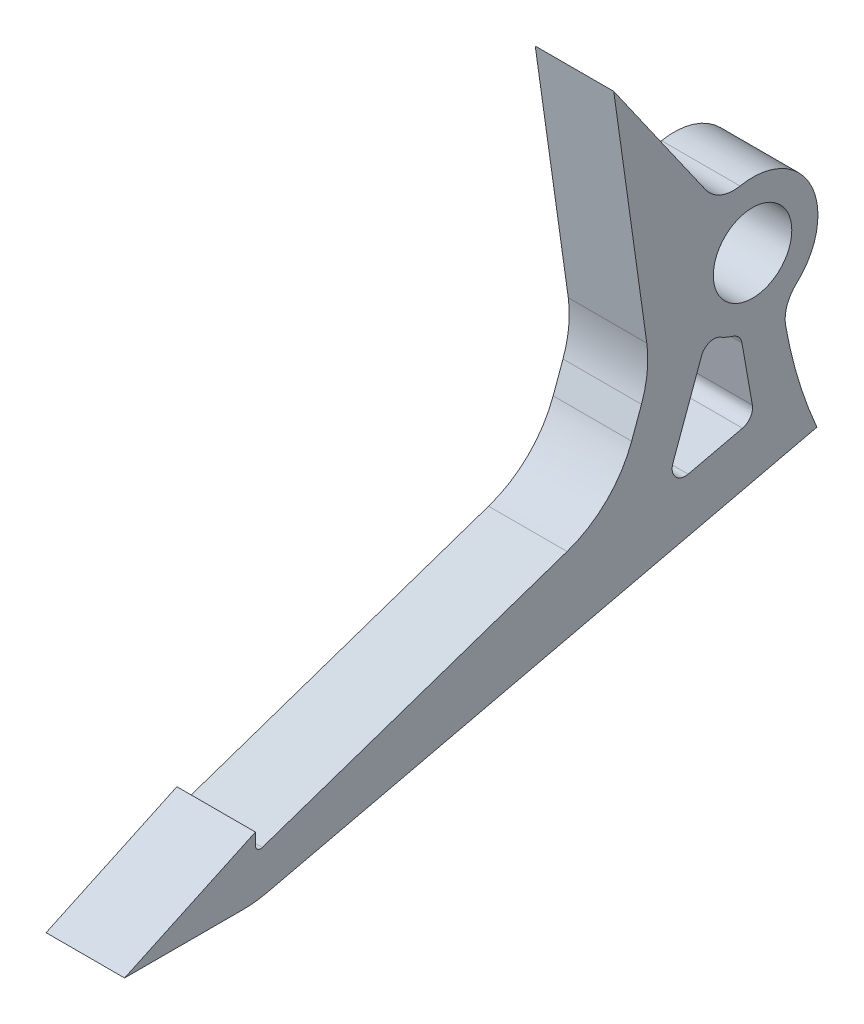
ISO-10303-21;
HEADER;
FILE_DESCRIPTION(('STEP AP214'),'2;1');
FILE_NAME('part.step','',(''),(''),'','','');
FILE_SCHEMA(('AUTOMOTIVE_DESIGN { 1 0 10303 214 1 1 1 1 }'));
ENDSEC;
DATA;
#1=APPLICATION_CONTEXT('core data for automotive mechanical design processes');
#2=APPLICATION_PROTOCOL_DEFINITION('international standard','automotive_design',2000,#1);
#3=PRODUCT_CONTEXT('',#1,'mechanical');
#4=PRODUCT('Part','Part','',(#3));
#5=PRODUCT_RELATED_PRODUCT_CATEGORY('part','',(#4));
#6=PRODUCT_DEFINITION_FORMATION('','',#4);
#7=PRODUCT_DEFINITION_CONTEXT('part definition',#1,'design');
#8=PRODUCT_DEFINITION('design','',#6,#7);
#9=PRODUCT_DEFINITION_SHAPE('','',#8);
#10=(LENGTH_UNIT() NAMED_UNIT(*) SI_UNIT(.MILLI.,.METRE.));
#11=(NAMED_UNIT(*) PLANE_ANGLE_UNIT() SI_UNIT($,.RADIAN.));
#12=(NAMED_UNIT(*) SI_UNIT($,.STERADIAN.) SOLID_ANGLE_UNIT());
#13=UNCERTAINTY_MEASURE_WITH_UNIT(LENGTH_MEASURE(1.E-05),#10,'distance_accuracy_value','');
#14=(GEOMETRIC_REPRESENTATION_CONTEXT(3) GLOBAL_UNCERTAINTY_ASSIGNED_CONTEXT((#13)) GLOBAL_UNIT_ASSIGNED_CONTEXT((#10,
#11,#12)) REPRESENTATION_CONTEXT('',''));
#15=CARTESIAN_POINT('',(0.,0.,0.));
#16=DIRECTION('',(0.,0.,1.));
#17=DIRECTION('',(1.,0.,0.));
#18=AXIS2_PLACEMENT_3D('',#15,#16,#17);
#19=CARTESIAN_POINT('',(-60.325,11.8418556346611,184.872192647918));
#20=DIRECTION('',(1.,0.,0.));
#21=DIRECTION('',(0.,0.,1.));
#22=AXIS2_PLACEMENT_3D('',#19,#20,#21);
#23=PLANE('',#22);
#24=DIRECTION('',(0.,-0.226904101241198,0.973917105733298));
#25=VECTOR('',#24,1.);
#26=CARTESIAN_POINT('',(-60.325,-38.0999999995451,242.8875));
#27=LINE('',#26,#25);
#28=CARTESIAN_POINT('',(-60.325,-22.225,174.748872410197));
#29=VERTEX_POINT('',#28);
#30=CARTESIAN_POINT('',(-60.325,-37.7687472424032,241.465697905031));
#31=VERTEX_POINT('',#30);
#32=EDGE_CURVE('E252',#29,#31,#27,.T.);
#33=ORIENTED_EDGE('',*,*,#32,.F.);
#34=CARTESIAN_POINT('',(-60.325,0.,123.825));
#35=DIRECTION('',(1.,0.,0.));
#36=DIRECTION('',(0.,0.,1.));
#37=AXIS2_PLACEMENT_3D('',#34,#35,#36);
#38=CIRCLE('',#37,55.5625);
#39=CARTESIAN_POINT('',(-60.325,-9.67130748368684,178.539323698699));
#40=VERTEX_POINT('',#39);
#41=EDGE_CURVE('E249',#40,#29,#38,.T.);
#42=ORIENTED_EDGE('',*,*,#41,.F.);
#43=CARTESIAN_POINT('',(-60.325,-8.9528674991844,174.474831081081));
#44=DIRECTION('',(1.,0.,0.));
#45=DIRECTION('',(0.,0.,1.));
#46=AXIS2_PLACEMENT_3D('',#43,#44,#45);
#47=CIRCLE('',#46,4.1275);
#48=CARTESIAN_POINT('',(-60.325,-5.89004440735816,177.241665184922));
#49=VERTEX_POINT('',#48);
#50=EDGE_CURVE('E246',#49,#40,#47,.T.);
#51=ORIENTED_EDGE('',*,*,#50,.F.);
#52=CARTESIAN_POINT('',(-60.325,0.,182.5625));
#53=DIRECTION('',(-1.,0.,0.));
#54=DIRECTION('',(0.,0.,-1.));
#55=AXIS2_PLACEMENT_3D('',#52,#53,#54);
#56=CIRCLE('',#55,7.93749999999999);
#57=CARTESIAN_POINT('',(-60.325,7.79069449648758,184.082034636788));
#58=VERTEX_POINT('',#57);
#59=EDGE_CURVE('E240',#58,#49,#56,.T.);
#60=ORIENTED_EDGE('',*,*,#59,.F.);
#61=CARTESIAN_POINT('',(-60.325,11.8418556346611,184.872192647918));
#62=DIRECTION('',(1.,0.,0.));
#63=DIRECTION('',(0.,0.,1.));
#64=AXIS2_PLACEMENT_3D('',#61,#62,#63);
#65=CIRCLE('',#64,4.1275);
#66=CARTESIAN_POINT('',(-60.325,9.47441889362217,188.25324271072));
#67=VERTEX_POINT('',#66);
#68=EDGE_CURVE('E238',#67,#58,#65,.T.);
#69=ORIENTED_EDGE('',*,*,#68,.F.);
#70=DIRECTION('',(0.,-0.819152044288991,-0.573576436351047));
#71=VECTOR('',#70,1.);
#72=CARTESIAN_POINT('',(-60.325,9.47441889362217,188.25324271072));
#73=LINE('',#72,#71);
#74=CARTESIAN_POINT('',(-60.325,25.4,199.404454651776));
#75=VERTEX_POINT('',#74);
#76=EDGE_CURVE('E216',#75,#67,#73,.T.);
#77=ORIENTED_EDGE('',*,*,#76,.F.);
#78=DIRECTION('',(0.,0.990224211928371,0.139484802436812));
#79=VECTOR('',#78,1.);
#80=CARTESIAN_POINT('',(-60.325,-6.19566556512215,194.953831130232));
#81=LINE('',#80,#79);
#82=CARTESIAN_POINT('',(-60.325,-3.058052243172,195.395801109418));
#83=VERTEX_POINT('',#82);
#84=EDGE_CURVE('E227',#83,#75,#81,.T.);
#85=ORIENTED_EDGE('',*,*,#84,.F.);
#86=CARTESIAN_POINT('',(-60.325,-4.82950923411951,207.971648600909));
#87=DIRECTION('',(-1.,0.,0.));
#88=DIRECTION('',(0.,0.,1.));
#89=AXIS2_PLACEMENT_3D('',#86,#87,#88);
#90=CIRCLE('',#89,12.7);
#91=CARTESIAN_POINT('',(-60.325,-9.17316505460819,196.03755231702));
#92=VERTEX_POINT('',#91);
#93=EDGE_CURVE('E325',#92,#83,#90,.F.);
#94=ORIENTED_EDGE('',*,*,#93,.F.);
#95=DIRECTION('',(0.,0.939692620778666,-0.342020143345566));
#96=VECTOR('',#95,1.);
#97=CARTESIAN_POINT('',(-60.325,-6.19566556512215,194.953831130232));
#98=LINE('',#97,#96);
#99=CARTESIAN_POINT('',(-60.325,-12.4523106077859,197.231063692281));
#100=VERTEX_POINT('',#99);
#101=EDGE_CURVE('E266',#100,#92,#98,.T.);
#102=ORIENTED_EDGE('',*,*,#101,.F.);
#103=CARTESIAN_POINT('',(-60.325,-8.1086547872972,209.16515997617));
#104=DIRECTION('',(-1.,0.,0.));
#105=DIRECTION('',(0.,0.,1.));
#106=AXIS2_PLACEMENT_3D('',#103,#104,#105);
#107=CIRCLE('',#106,12.7);
#108=CARTESIAN_POINT('',(-60.325,-20.1295882858705,205.06794655448));
#109=VERTEX_POINT('',#108);
#110=EDGE_CURVE('E330',#109,#100,#107,.F.);
#111=ORIENTED_EDGE('',*,*,#110,.F.);
#112=DIRECTION('',(0.,0.322615230054343,-0.946530196738056));
#113=VECTOR('',#112,1.);
#114=CARTESIAN_POINT('',(-60.325,-18.1674625629956,199.311208888423));
#115=LINE('',#114,#113);
#116=CARTESIAN_POINT('',(-60.325,-32.7337419968429,242.047639328916));
#117=VERTEX_POINT('',#116);
#118=EDGE_CURVE('E263',#117,#109,#115,.T.);
#119=ORIENTED_EDGE('',*,*,#118,.F.);
#120=CARTESIAN_POINT('',(-60.325,-32.1326953219142,242.2525));
#121=DIRECTION('',(-1.,0.,0.));
#122=DIRECTION('',(0.,0.,1.));
#123=AXIS2_PLACEMENT_3D('',#120,#121,#122);
#124=CIRCLE('',#123,0.635);
#125=CARTESIAN_POINT('',(-60.325,-32.1326953219142,242.8875));
#126=VERTEX_POINT('',#125);
#127=EDGE_CURVE('E380',#126,#117,#124,.F.);
#128=ORIENTED_EDGE('',*,*,#127,.F.);
#129=DIRECTION('',(0.,-1.,0.));
#130=VECTOR('',#129,1.);
#131=CARTESIAN_POINT('',(-60.325,-33.0199999995451,242.8875));
#132=LINE('',#131,#130);
#133=CARTESIAN_POINT('',(-60.325,-30.6973659274248,242.8875));
#134=VERTEX_POINT('',#133);
#135=EDGE_CURVE('E260',#134,#126,#132,.T.);
#136=ORIENTED_EDGE('',*,*,#135,.F.);
#137=DIRECTION('',(0.,0.422618261712625,-0.906307787049741));
#138=VECTOR('',#137,1.);
#139=CARTESIAN_POINT('',(-60.325,-30.6973659274248,242.8875));
#140=LINE('',#139,#138);
#141=CARTESIAN_POINT('',(-60.325,-38.1000000000367,258.7625));
#142=VERTEX_POINT('',#141);
#143=EDGE_CURVE('E257',#142,#134,#140,.T.);
#144=ORIENTED_EDGE('',*,*,#143,.F.);
#145=DIRECTION('',(0.,-3.0969540143215E-11,1.));
#146=VECTOR('',#145,1.);
#147=CARTESIAN_POINT('',(-60.325,-38.1000000000367,258.7625));
#148=LINE('',#147,#146);
#149=CARTESIAN_POINT('',(-60.325,-38.0999999995903,244.347379990401));
#150=VERTEX_POINT('',#149);
#151=EDGE_CURVE('E254',#150,#142,#148,.T.);
#152=ORIENTED_EDGE('',*,*,#151,.F.);
#153=CARTESIAN_POINT('',(-60.325,-25.3999999995903,244.347379990794));
#154=DIRECTION('',(-1.,0.,0.));
#155=DIRECTION('',(0.,0.,1.));
#156=AXIS2_PLACEMENT_3D('',#153,#154,#155);
#157=CIRCLE('',#156,12.7);
#158=EDGE_CURVE('E12',#31,#150,#157,.T.);
#159=ORIENTED_EDGE('',*,*,#158,.F.);
#160=EDGE_LOOP('',(#33,#42,#51,#60,#69,#77,#85,#94,#102,#111,#119,#128,#136,#144,#152,#159));
#161=FACE_BOUND('',#160,.T.);
#162=CARTESIAN_POINT('',(-60.325,0.,182.5625));
#163=DIRECTION('',(-1.,0.,0.));
#164=DIRECTION('',(0.,0.,1.));
#165=AXIS2_PLACEMENT_3D('',#162,#163,#164);
#166=CIRCLE('',#165,4.76250000000001);
#167=CARTESIAN_POINT('',(-60.325,0.,177.8));
#168=VERTEX_POINT('',#167);
#169=EDGE_CURVE('E272',#168,#168,#166,.T.);
#170=ORIENTED_EDGE('',*,*,#169,.T.);
#171=EDGE_LOOP('',(#170));
#172=FACE_BOUND('',#171,.T.);
#173=DIRECTION('',(0.,0.939692620778666,-0.342020143345568));
#174=VECTOR('',#173,1.);
#175=CARTESIAN_POINT('',(-60.325,-5.75019849137348,188.03416551973));
#176=LINE('',#175,#174);
#177=CARTESIAN_POINT('',(-60.325,-17.2552388929691,192.221657770217));
#178=VERTEX_POINT('',#177);
#179=CARTESIAN_POINT('',(-60.325,-7.73946926422555,188.758200868992));
#180=VERTEX_POINT('',#179);
#181=EDGE_CURVE('E806',#178,#180,#176,.T.);
#182=ORIENTED_EDGE('',*,*,#181,.T.);
#183=CARTESIAN_POINT('',(-60.325,-8.28242624178663,187.266438833506));
#184=DIRECTION('',(-1.,0.,0.));
#185=DIRECTION('',(0.,0.,1.));
#186=AXIS2_PLACEMENT_3D('',#183,#184,#185);
#187=CIRCLE('',#186,1.5875);
#188=CARTESIAN_POINT('',(-60.325,-6.90202186815552,186.482449027922));
#189=VERTEX_POINT('',#188);
#190=EDGE_CURVE('E358',#189,#180,#187,.F.);
#191=ORIENTED_EDGE('',*,*,#190,.F.);
#192=CARTESIAN_POINT('',(-60.325,0.,182.5625));
#193=DIRECTION('',(1.,0.,0.));
#194=DIRECTION('',(0.,0.,1.));
#195=AXIS2_PLACEMENT_3D('',#192,#193,#194);
#196=CIRCLE('',#195,7.9375);
#197=CARTESIAN_POINT('',(-60.325,-7.57366766743474,184.938097674955));
#198=VERTEX_POINT('',#197);
#199=EDGE_CURVE('E803',#189,#198,#196,.T.);
#200=ORIENTED_EDGE('',*,*,#199,.T.);
#201=CARTESIAN_POINT('',(-60.325,-9.08840120092169,185.413217209947));
#202=DIRECTION('',(-1.,0.,0.));
#203=DIRECTION('',(0.,0.,1.));
#204=AXIS2_PLACEMENT_3D('',#201,#202,#203);
#205=CIRCLE('',#204,1.5875);
#206=CARTESIAN_POINT('',(-60.325,-8.81207812995921,183.849950818555));
#207=VERTEX_POINT('',#206);
#208=EDGE_CURVE('E364',#207,#198,#205,.F.);
#209=ORIENTED_EDGE('',*,*,#208,.F.);
#210=DIRECTION('',(0.,-0.984734734734735,-0.17406177698424));
#211=VECTOR('',#210,1.);
#212=CARTESIAN_POINT('',(-60.325,-17.4688161294503,182.319785235959));
#213=LINE('',#212,#211);
#214=CARTESIAN_POINT('',(-60.325,-15.9876843333391,182.581590190415));
#215=VERTEX_POINT('',#214);
#216=EDGE_CURVE('E799',#207,#215,#213,.T.);
#217=ORIENTED_EDGE('',*,*,#216,.T.);
#218=CARTESIAN_POINT('',(-60.325,-16.2640074043016,184.144856581806));
#219=DIRECTION('',(-1.,0.,0.));
#220=DIRECTION('',(0.,0.,1.));
#221=AXIS2_PLACEMENT_3D('',#218,#219,#220);
#222=CIRCLE('',#221,1.5875);
#223=CARTESIAN_POINT('',(-60.325,-17.8101008096507,183.784646321075));
#224=VERTEX_POINT('',#223);
#225=EDGE_CURVE('E370',#224,#215,#222,.F.);
#226=ORIENTED_EDGE('',*,*,#225,.F.);
#227=DIRECTION('',(0.,-0.226904101247864,0.973917105731745));
#228=VECTOR('',#227,1.);
#229=CARTESIAN_POINT('',(-60.325,-20.0093029322549,193.224055103846));
#230=LINE('',#229,#228);
#231=CARTESIAN_POINT('',(-60.325,-19.3442892758793,190.369685474));
#232=VERTEX_POINT('',#231);
#233=EDGE_CURVE('E822',#224,#232,#230,.T.);
#234=ORIENTED_EDGE('',*,*,#233,.T.);
#235=CARTESIAN_POINT('',(-60.325,-17.7981958705302,190.729895734731));
#236=DIRECTION('',(-1.,0.,0.));
#237=DIRECTION('',(0.,0.,1.));
#238=AXIS2_PLACEMENT_3D('',#235,#236,#237);
#239=CIRCLE('',#238,1.5875);
#240=EDGE_CURVE('E352',#178,#232,#239,.F.);
#241=ORIENTED_EDGE('',*,*,#240,.F.);
#242=EDGE_LOOP('',(#182,#191,#200,#209,#217,#226,#234,#241));
#243=FACE_BOUND('',#242,.T.);
#244=ADVANCED_FACE('F53',(#161,#172,#243),#23,.T.);
#245=CARTESIAN_POINT('',(-69.85,11.8418556346611,184.872192647918));
#246=DIRECTION('',(1.,0.,0.));
#247=DIRECTION('',(0.,0.,1.));
#248=AXIS2_PLACEMENT_3D('',#245,#246,#247);
#249=PLANE('',#248);
#250=CARTESIAN_POINT('',(-69.85,0.,182.5625));
#251=DIRECTION('',(-1.,0.,0.));
#252=DIRECTION('',(0.,0.,1.));
#253=AXIS2_PLACEMENT_3D('',#250,#251,#252);
#254=CIRCLE('',#253,4.76250000000001);
#255=CARTESIAN_POINT('',(-69.85,0.,177.8));
#256=VERTEX_POINT('',#255);
#257=EDGE_CURVE('E802',#256,#256,#254,.T.);
#258=ORIENTED_EDGE('',*,*,#257,.F.);
#259=EDGE_LOOP('',(#258));
#260=FACE_BOUND('',#259,.T.);
#261=DIRECTION('',(0.,-3.0969540143215E-11,1.));
#262=VECTOR('',#261,1.);
#263=CARTESIAN_POINT('',(-69.85,-38.1000000000367,258.7625));
#264=LINE('',#263,#262);
#265=CARTESIAN_POINT('',(-69.85,-38.0999999995903,244.347379990401));
#266=VERTEX_POINT('',#265);
#267=CARTESIAN_POINT('',(-69.85,-38.1000000000367,258.7625));
#268=VERTEX_POINT('',#267);
#269=EDGE_CURVE('E289',#266,#268,#264,.T.);
#270=ORIENTED_EDGE('',*,*,#269,.T.);
#271=DIRECTION('',(0.,0.422618261712625,-0.906307787049741));
#272=VECTOR('',#271,1.);
#273=CARTESIAN_POINT('',(-69.85,-30.6973659274248,242.8875));
#274=LINE('',#273,#272);
#275=CARTESIAN_POINT('',(-69.85,-30.6973659274248,242.8875));
#276=VERTEX_POINT('',#275);
#277=EDGE_CURVE('E292',#268,#276,#274,.T.);
#278=ORIENTED_EDGE('',*,*,#277,.T.);
#279=DIRECTION('',(0.,-1.,0.));
#280=VECTOR('',#279,1.);
#281=CARTESIAN_POINT('',(-69.85,-33.0199999995451,242.8875));
#282=LINE('',#281,#280);
#283=CARTESIAN_POINT('',(-69.85,-32.1326953219142,242.8875));
#284=VERTEX_POINT('',#283);
#285=EDGE_CURVE('E295',#276,#284,#282,.T.);
#286=ORIENTED_EDGE('',*,*,#285,.T.);
#287=CARTESIAN_POINT('',(-69.85,-32.1326953219142,242.2525));
#288=DIRECTION('',(-1.,0.,0.));
#289=DIRECTION('',(0.,0.,1.));
#290=AXIS2_PLACEMENT_3D('',#287,#288,#289);
#291=CIRCLE('',#290,0.635);
#292=CARTESIAN_POINT('',(-69.85,-32.7337419968429,242.047639328916));
#293=VERTEX_POINT('',#292);
#294=EDGE_CURVE('E377',#293,#284,#291,.T.);
#295=ORIENTED_EDGE('',*,*,#294,.F.);
#296=DIRECTION('',(0.,0.322615230054343,-0.946530196738056));
#297=VECTOR('',#296,1.);
#298=CARTESIAN_POINT('',(-69.85,-18.1674625629956,199.311208888423));
#299=LINE('',#298,#297);
#300=CARTESIAN_POINT('',(-69.85,-20.1295882858705,205.06794655448));
#301=VERTEX_POINT('',#300);
#302=EDGE_CURVE('E298',#293,#301,#299,.T.);
#303=ORIENTED_EDGE('',*,*,#302,.T.);
#304=CARTESIAN_POINT('',(-69.85,-8.1086547872972,209.16515997617));
#305=DIRECTION('',(-1.,0.,0.));
#306=DIRECTION('',(0.,0.,1.));
#307=AXIS2_PLACEMENT_3D('',#304,#305,#306);
#308=CIRCLE('',#307,12.7);
#309=CARTESIAN_POINT('',(-69.85,-12.4523106077859,197.231063692281));
#310=VERTEX_POINT('',#309);
#311=EDGE_CURVE('E327',#310,#301,#308,.T.);
#312=ORIENTED_EDGE('',*,*,#311,.F.);
#313=DIRECTION('',(0.,0.939692620778666,-0.342020143345566));
#314=VECTOR('',#313,1.);
#315=CARTESIAN_POINT('',(-69.85,-6.19566556512215,194.953831130232));
#316=LINE('',#315,#314);
#317=CARTESIAN_POINT('',(-69.85,-9.17316505460819,196.03755231702));
#318=VERTEX_POINT('',#317);
#319=EDGE_CURVE('E232',#310,#318,#316,.T.);
#320=ORIENTED_EDGE('',*,*,#319,.T.);
#321=CARTESIAN_POINT('',(-69.85,-4.82950923411951,207.971648600909));
#322=DIRECTION('',(-1.,0.,0.));
#323=DIRECTION('',(0.,0.,1.));
#324=AXIS2_PLACEMENT_3D('',#321,#322,#323);
#325=CIRCLE('',#324,12.7);
#326=CARTESIAN_POINT('',(-69.85,-3.058052243172,195.395801109418));
#327=VERTEX_POINT('',#326);
#328=EDGE_CURVE('E322',#327,#318,#325,.T.);
#329=ORIENTED_EDGE('',*,*,#328,.F.);
#330=DIRECTION('',(0.,0.990224211928371,0.139484802436812));
#331=VECTOR('',#330,1.);
#332=CARTESIAN_POINT('',(-69.85,-6.19566556512215,194.953831130232));
#333=LINE('',#332,#331);
#334=CARTESIAN_POINT('',(-69.85,25.4,199.404454651776));
#335=VERTEX_POINT('',#334);
#336=EDGE_CURVE('E270',#327,#335,#333,.T.);
#337=ORIENTED_EDGE('',*,*,#336,.T.);
#338=DIRECTION('',(0.,-0.819152044288991,-0.573576436351047));
#339=VECTOR('',#338,1.);
#340=CARTESIAN_POINT('',(-69.85,9.47441889362217,188.25324271072));
#341=LINE('',#340,#339);
#342=CARTESIAN_POINT('',(-69.85,9.47441889362217,188.25324271072));
#343=VERTEX_POINT('',#342);
#344=EDGE_CURVE('E219',#335,#343,#341,.T.);
#345=ORIENTED_EDGE('',*,*,#344,.T.);
#346=CARTESIAN_POINT('',(-69.85,11.8418556346611,184.872192647918));
#347=DIRECTION('',(1.,0.,0.));
#348=DIRECTION('',(0.,0.,1.));
#349=AXIS2_PLACEMENT_3D('',#346,#347,#348);
#350=CIRCLE('',#349,4.1275);
#351=CARTESIAN_POINT('',(-69.85,7.79069449648758,184.082034636788));
#352=VERTEX_POINT('',#351);
#353=EDGE_CURVE('E274',#343,#352,#350,.T.);
#354=ORIENTED_EDGE('',*,*,#353,.T.);
#355=CARTESIAN_POINT('',(-69.85,0.,182.5625));
#356=DIRECTION('',(-1.,0.,0.));
#357=DIRECTION('',(0.,0.,1.));
#358=AXIS2_PLACEMENT_3D('',#355,#356,#357);
#359=CIRCLE('',#358,7.9375);
#360=CARTESIAN_POINT('',(-69.85,-5.89004440735816,177.241665184922));
#361=VERTEX_POINT('',#360);
#362=EDGE_CURVE('E277',#352,#361,#359,.T.);
#363=ORIENTED_EDGE('',*,*,#362,.T.);
#364=CARTESIAN_POINT('',(-69.85,-8.9528674991844,174.474831081081));
#365=DIRECTION('',(1.,0.,0.));
#366=DIRECTION('',(0.,0.,1.));
#367=AXIS2_PLACEMENT_3D('',#364,#365,#366);
#368=CIRCLE('',#367,4.1275);
#369=CARTESIAN_POINT('',(-69.85,-9.67130748368684,178.539323698699));
#370=VERTEX_POINT('',#369);
#371=EDGE_CURVE('E280',#361,#370,#368,.T.);
#372=ORIENTED_EDGE('',*,*,#371,.T.);
#373=CARTESIAN_POINT('',(-69.85,0.,123.825));
#374=DIRECTION('',(1.,0.,0.));
#375=DIRECTION('',(0.,0.,1.));
#376=AXIS2_PLACEMENT_3D('',#373,#374,#375);
#377=CIRCLE('',#376,55.5625);
#378=CARTESIAN_POINT('',(-69.85,-22.225,174.748872410197));
#379=VERTEX_POINT('',#378);
#380=EDGE_CURVE('E283',#370,#379,#377,.T.);
#381=ORIENTED_EDGE('',*,*,#380,.T.);
#382=DIRECTION('',(0.,-0.226904101241198,0.973917105733298));
#383=VECTOR('',#382,1.);
#384=CARTESIAN_POINT('',(-69.85,-38.0999999995451,242.8875));
#385=LINE('',#384,#383);
#386=CARTESIAN_POINT('',(-69.85,-37.7687472424032,241.465697905031));
#387=VERTEX_POINT('',#386);
#388=EDGE_CURVE('E286',#379,#387,#385,.T.);
#389=ORIENTED_EDGE('',*,*,#388,.T.);
#390=CARTESIAN_POINT('',(-69.85,-25.3999999995903,244.347379990794));
#391=DIRECTION('',(-1.,0.,0.));
#392=DIRECTION('',(0.,0.,1.));
#393=AXIS2_PLACEMENT_3D('',#390,#391,#392);
#394=CIRCLE('',#393,12.7);
#395=EDGE_CURVE('E385',#266,#387,#394,.F.);
#396=ORIENTED_EDGE('',*,*,#395,.F.);
#397=EDGE_LOOP('',(#270,#278,#286,#295,#303,#312,#320,#329,#337,#345,#354,#363,#372,#381,#389,#396));
#398=FACE_BOUND('',#397,.T.);
#399=DIRECTION('',(0.,-0.984734734734735,-0.17406177698424));
#400=VECTOR('',#399,1.);
#401=CARTESIAN_POINT('',(-69.85,-17.4688161294503,182.319785235959));
#402=LINE('',#401,#400);
#403=CARTESIAN_POINT('',(-69.85,-8.81207812995921,183.849950818555));
#404=VERTEX_POINT('',#403);
#405=CARTESIAN_POINT('',(-69.85,-15.9876843333391,182.581590190415));
#406=VERTEX_POINT('',#405);
#407=EDGE_CURVE('E819',#404,#406,#402,.T.);
#408=ORIENTED_EDGE('',*,*,#407,.F.);
#409=CARTESIAN_POINT('',(-69.85,-9.08840120092169,185.413217209947));
#410=DIRECTION('',(-1.,0.,0.));
#411=DIRECTION('',(0.,0.,1.));
#412=AXIS2_PLACEMENT_3D('',#409,#410,#411);
#413=CIRCLE('',#412,1.5875);
#414=CARTESIAN_POINT('',(-69.85,-7.57366766743474,184.938097674955));
#415=VERTEX_POINT('',#414);
#416=EDGE_CURVE('E361',#415,#404,#413,.T.);
#417=ORIENTED_EDGE('',*,*,#416,.F.);
#418=CARTESIAN_POINT('',(-69.85,0.,182.5625));
#419=DIRECTION('',(1.,0.,0.));
#420=DIRECTION('',(0.,0.,1.));
#421=AXIS2_PLACEMENT_3D('',#418,#419,#420);
#422=CIRCLE('',#421,7.9375);
#423=CARTESIAN_POINT('',(-69.85,-6.90202186815552,186.482449027922));
#424=VERTEX_POINT('',#423);
#425=EDGE_CURVE('E816',#424,#415,#422,.T.);
#426=ORIENTED_EDGE('',*,*,#425,.F.);
#427=CARTESIAN_POINT('',(-69.85,-8.28242624178663,187.266438833506));
#428=DIRECTION('',(-1.,0.,0.));
#429=DIRECTION('',(0.,0.,1.));
#430=AXIS2_PLACEMENT_3D('',#427,#428,#429);
#431=CIRCLE('',#430,1.5875);
#432=CARTESIAN_POINT('',(-69.85,-7.73946926422555,188.758200868992));
#433=VERTEX_POINT('',#432);
#434=EDGE_CURVE('E355',#433,#424,#431,.T.);
#435=ORIENTED_EDGE('',*,*,#434,.F.);
#436=DIRECTION('',(0.,0.939692620778666,-0.342020143345568));
#437=VECTOR('',#436,1.);
#438=CARTESIAN_POINT('',(-69.85,-5.75019849137348,188.03416551973));
#439=LINE('',#438,#437);
#440=CARTESIAN_POINT('',(-69.85,-17.2552388929691,192.221657770217));
#441=VERTEX_POINT('',#440);
#442=EDGE_CURVE('E813',#441,#433,#439,.T.);
#443=ORIENTED_EDGE('',*,*,#442,.F.);
#444=CARTESIAN_POINT('',(-69.85,-17.7981958705302,190.729895734731));
#445=DIRECTION('',(-1.,0.,0.));
#446=DIRECTION('',(0.,0.,1.));
#447=AXIS2_PLACEMENT_3D('',#444,#445,#446);
#448=CIRCLE('',#447,1.5875);
#449=CARTESIAN_POINT('',(-69.85,-19.3442892758793,190.369685474));
#450=VERTEX_POINT('',#449);
#451=EDGE_CURVE('E349',#450,#441,#448,.T.);
#452=ORIENTED_EDGE('',*,*,#451,.F.);
#453=DIRECTION('',(0.,-0.226904101247864,0.973917105731745));
#454=VECTOR('',#453,1.);
#455=CARTESIAN_POINT('',(-69.85,-20.0093029322549,193.224055103846));
#456=LINE('',#455,#454);
#457=CARTESIAN_POINT('',(-69.85,-17.8101008096507,183.784646321075));
#458=VERTEX_POINT('',#457);
#459=EDGE_CURVE('E810',#458,#450,#456,.T.);
#460=ORIENTED_EDGE('',*,*,#459,.F.);
#461=CARTESIAN_POINT('',(-69.85,-16.2640074043016,184.144856581806));
#462=DIRECTION('',(-1.,0.,0.));
#463=DIRECTION('',(0.,0.,1.));
#464=AXIS2_PLACEMENT_3D('',#461,#462,#463);
#465=CIRCLE('',#464,1.5875);
#466=EDGE_CURVE('E367',#406,#458,#465,.T.);
#467=ORIENTED_EDGE('',*,*,#466,.F.);
#468=EDGE_LOOP('',(#408,#417,#426,#435,#443,#452,#460,#467));
#469=FACE_BOUND('',#468,.T.);
#470=ADVANCED_FACE('F389',(#260,#398,#469),#249,.F.);
#471=CARTESIAN_POINT('',(-60.325,-6.19566556512215,194.953831130232));
#472=DIRECTION('',(0.,0.139484802436812,-0.990224211928371));
#473=DIRECTION('',(0.,0.990224211928371,0.139484802436812));
#474=AXIS2_PLACEMENT_3D('',#471,#472,#473);
#475=PLANE('',#474);
#476=ORIENTED_EDGE('',*,*,#84,.T.);
#477=DIRECTION('',(-1.,0.,0.));
#478=VECTOR('',#477,1.);
#479=CARTESIAN_POINT('',(-60.325,25.4,199.404454651776));
#480=LINE('',#479,#478);
#481=EDGE_CURVE('E212',#75,#335,#480,.T.);
#482=ORIENTED_EDGE('',*,*,#481,.T.);
#483=ORIENTED_EDGE('',*,*,#336,.F.);
#484=DIRECTION('',(-1.,0.,0.));
#485=VECTOR('',#484,1.);
#486=CARTESIAN_POINT('',(-69.85,-3.058052243172,195.395801109418));
#487=LINE('',#486,#485);
#488=EDGE_CURVE('E223',#83,#327,#487,.T.);
#489=ORIENTED_EDGE('',*,*,#488,.F.);
#490=EDGE_LOOP('',(#476,#482,#483,#489));
#491=FACE_BOUND('',#490,.T.);
#492=ADVANCED_FACE('F228',(#491),#475,.F.);
#493=CARTESIAN_POINT('',(-60.325,9.47441889362217,188.25324271072));
#494=DIRECTION('',(0.,-0.573576436351047,0.819152044288991));
#495=DIRECTION('',(0.,-0.819152044288991,-0.573576436351047));
#496=AXIS2_PLACEMENT_3D('',#493,#494,#495);
#497=PLANE('',#496);
#498=ORIENTED_EDGE('',*,*,#344,.F.);
#499=ORIENTED_EDGE('',*,*,#481,.F.);
#500=ORIENTED_EDGE('',*,*,#76,.T.);
#501=DIRECTION('',(-1.,0.,0.));
#502=VECTOR('',#501,1.);
#503=CARTESIAN_POINT('',(-60.325,9.47441889362217,188.25324271072));
#504=LINE('',#503,#502);
#505=EDGE_CURVE('E224',#67,#343,#504,.T.);
#506=ORIENTED_EDGE('',*,*,#505,.T.);
#507=EDGE_LOOP('',(#498,#499,#500,#506));
#508=FACE_BOUND('',#507,.T.);
#509=ADVANCED_FACE('F214',(#508),#497,.F.);
#510=CARTESIAN_POINT('',(-60.325,11.8418556346611,184.872192647918));
#511=DIRECTION('',(-1.,0.,0.));
#512=DIRECTION('',(0.,0.,-1.));
#513=AXIS2_PLACEMENT_3D('',#510,#511,#512);
#514=CYLINDRICAL_SURFACE('',#513,4.1275);
#515=ORIENTED_EDGE('',*,*,#353,.F.);
#516=ORIENTED_EDGE('',*,*,#505,.F.);
#517=ORIENTED_EDGE('',*,*,#68,.T.);
#518=DIRECTION('',(-1.,0.,0.));
#519=VECTOR('',#518,1.);
#520=CARTESIAN_POINT('',(-60.325,7.79069449648758,184.082034636788));
#521=LINE('',#520,#519);
#522=EDGE_CURVE('E312',#58,#352,#521,.T.);
#523=ORIENTED_EDGE('',*,*,#522,.T.);
#524=EDGE_LOOP('',(#515,#516,#517,#523));
#525=FACE_BOUND('',#524,.T.);
#526=ADVANCED_FACE('F472',(#525),#514,.F.);
#527=CARTESIAN_POINT('',(-60.325,0.,182.5625));
#528=DIRECTION('',(-1.,0.,0.));
#529=DIRECTION('',(0.,0.,-1.));
#530=AXIS2_PLACEMENT_3D('',#527,#528,#529);
#531=CYLINDRICAL_SURFACE('',#530,7.9375);
#532=ORIENTED_EDGE('',*,*,#362,.F.);
#533=ORIENTED_EDGE('',*,*,#522,.F.);
#534=ORIENTED_EDGE('',*,*,#59,.T.);
#535=DIRECTION('',(-1.,0.,0.));
#536=VECTOR('',#535,1.);
#537=CARTESIAN_POINT('',(-60.325,-5.89004440735816,177.241665184922));
#538=LINE('',#537,#536);
#539=EDGE_CURVE('E310',#49,#361,#538,.T.);
#540=ORIENTED_EDGE('',*,*,#539,.T.);
#541=EDGE_LOOP('',(#532,#533,#534,#540));
#542=FACE_BOUND('',#541,.T.);
#543=ADVANCED_FACE('F468',(#542),#531,.T.);
#544=CARTESIAN_POINT('',(-60.325,-8.9528674991844,174.474831081081));
#545=DIRECTION('',(-1.,0.,0.));
#546=DIRECTION('',(0.,0.,-1.));
#547=AXIS2_PLACEMENT_3D('',#544,#545,#546);
#548=CYLINDRICAL_SURFACE('',#547,4.1275);
#549=ORIENTED_EDGE('',*,*,#371,.F.);
#550=ORIENTED_EDGE('',*,*,#539,.F.);
#551=ORIENTED_EDGE('',*,*,#50,.T.);
#552=DIRECTION('',(-1.,0.,0.));
#553=VECTOR('',#552,1.);
#554=CARTESIAN_POINT('',(-60.325,-9.67130748368684,178.539323698699));
#555=LINE('',#554,#553);
#556=EDGE_CURVE('E308',#40,#370,#555,.T.);
#557=ORIENTED_EDGE('',*,*,#556,.T.);
#558=EDGE_LOOP('',(#549,#550,#551,#557));
#559=FACE_BOUND('',#558,.T.);
#560=ADVANCED_FACE('F465',(#559),#548,.F.);
#561=CARTESIAN_POINT('',(-60.325,0.,123.825));
#562=DIRECTION('',(-1.,0.,0.));
#563=DIRECTION('',(0.,0.,-1.));
#564=AXIS2_PLACEMENT_3D('',#561,#562,#563);
#565=CYLINDRICAL_SURFACE('',#564,55.5625);
#566=ORIENTED_EDGE('',*,*,#380,.F.);
#567=ORIENTED_EDGE('',*,*,#556,.F.);
#568=ORIENTED_EDGE('',*,*,#41,.T.);
#569=DIRECTION('',(-1.,0.,0.));
#570=VECTOR('',#569,1.);
#571=CARTESIAN_POINT('',(-60.325,-22.225,174.748872410197));
#572=LINE('',#571,#570);
#573=EDGE_CURVE('E306',#29,#379,#572,.T.);
#574=ORIENTED_EDGE('',*,*,#573,.T.);
#575=EDGE_LOOP('',(#566,#567,#568,#574));
#576=FACE_BOUND('',#575,.T.);
#577=ADVANCED_FACE('F395',(#576),#565,.F.);
#578=CARTESIAN_POINT('',(-60.325,-38.0999999995451,242.8875));
#579=DIRECTION('',(0.,0.973917105733298,0.226904101241198));
#580=DIRECTION('',(0.,-0.226904101241198,0.973917105733298));
#581=AXIS2_PLACEMENT_3D('',#578,#579,#580);
#582=PLANE('',#581);
#583=ORIENTED_EDGE('',*,*,#388,.F.);
#584=ORIENTED_EDGE('',*,*,#573,.F.);
#585=ORIENTED_EDGE('',*,*,#32,.T.);
#586=DIRECTION('',(-1.,0.,0.));
#587=VECTOR('',#586,1.);
#588=CARTESIAN_POINT('',(-60.325,-37.7687472424032,241.465697905031));
#589=LINE('',#588,#587);
#590=EDGE_CURVE('E61',#387,#31,#589,.F.);
#591=ORIENTED_EDGE('',*,*,#590,.F.);
#592=EDGE_LOOP('',(#583,#584,#585,#591));
#593=FACE_BOUND('',#592,.T.);
#594=ADVANCED_FACE('F392',(#593),#582,.F.);
#595=CARTESIAN_POINT('',(-60.325,-38.1000000000367,258.7625));
#596=DIRECTION('',(0.,1.,3.0969540143215E-11));
#597=DIRECTION('',(0.,-3.09695401432151E-11,1.));
#598=AXIS2_PLACEMENT_3D('',#595,#596,#597);
#599=PLANE('',#598);
#600=ORIENTED_EDGE('',*,*,#151,.T.);
#601=DIRECTION('',(-1.,0.,0.));
#602=VECTOR('',#601,1.);
#603=CARTESIAN_POINT('',(-60.325,-38.1000000000367,258.7625));
#604=LINE('',#603,#602);
#605=EDGE_CURVE('E304',#142,#268,#604,.T.);
#606=ORIENTED_EDGE('',*,*,#605,.T.);
#607=ORIENTED_EDGE('',*,*,#269,.F.);
#608=DIRECTION('',(-1.,0.,0.));
#609=VECTOR('',#608,1.);
#610=CARTESIAN_POINT('',(-60.325,-38.0999999995903,244.347379990401));
#611=LINE('',#610,#609);
#612=EDGE_CURVE('E383',#150,#266,#611,.T.);
#613=ORIENTED_EDGE('',*,*,#612,.F.);
#614=EDGE_LOOP('',(#600,#606,#607,#613));
#615=FACE_BOUND('',#614,.T.);
#616=ADVANCED_FACE('F401',(#615),#599,.F.);
#617=CARTESIAN_POINT('',(-60.325,-30.6973659274248,242.8875));
#618=DIRECTION('',(0.,-0.906307787049741,-0.422618261712625));
#619=DIRECTION('',(0.,0.422618261712625,-0.906307787049742));
#620=AXIS2_PLACEMENT_3D('',#617,#618,#619);
#621=PLANE('',#620);
#622=ORIENTED_EDGE('',*,*,#277,.F.);
#623=ORIENTED_EDGE('',*,*,#605,.F.);
#624=ORIENTED_EDGE('',*,*,#143,.T.);
#625=DIRECTION('',(-1.,0.,0.));
#626=VECTOR('',#625,1.);
#627=CARTESIAN_POINT('',(-60.325,-30.6973659274248,242.8875));
#628=LINE('',#627,#626);
#629=EDGE_CURVE('E269',#134,#276,#628,.T.);
#630=ORIENTED_EDGE('',*,*,#629,.T.);
#631=EDGE_LOOP('',(#622,#623,#624,#630));
#632=FACE_BOUND('',#631,.T.);
#633=ADVANCED_FACE('F406',(#632),#621,.F.);
#634=CARTESIAN_POINT('',(-60.325,-33.0199999995451,242.8875));
#635=DIRECTION('',(0.,0.,1.));
#636=DIRECTION('',(-1.,0.,0.));
#637=AXIS2_PLACEMENT_3D('',#634,#635,#636);
#638=PLANE('',#637);
#639=ORIENTED_EDGE('',*,*,#285,.F.);
#640=ORIENTED_EDGE('',*,*,#629,.F.);
#641=ORIENTED_EDGE('',*,*,#135,.T.);
#642=DIRECTION('',(-1.,0.,0.));
#643=VECTOR('',#642,1.);
#644=CARTESIAN_POINT('',(-60.325,-32.1326953219142,242.8875));
#645=LINE('',#644,#643);
#646=EDGE_CURVE('E375',#284,#126,#645,.F.);
#647=ORIENTED_EDGE('',*,*,#646,.F.);
#648=EDGE_LOOP('',(#639,#640,#641,#647));
#649=FACE_BOUND('',#648,.T.);
#650=ADVANCED_FACE('F408',(#649),#638,.F.);
#651=CARTESIAN_POINT('',(-60.325,-18.1674625629956,199.311208888423));
#652=DIRECTION('',(0.,-0.946530196738056,-0.322615230054343));
#653=DIRECTION('',(0.,0.322615230054343,-0.946530196738056));
#654=AXIS2_PLACEMENT_3D('',#651,#652,#653);
#655=PLANE('',#654);
#656=ORIENTED_EDGE('',*,*,#118,.T.);
#657=DIRECTION('',(-1.,0.,0.));
#658=VECTOR('',#657,1.);
#659=CARTESIAN_POINT('',(-60.325,-20.1295882858705,205.06794655448));
#660=LINE('',#659,#658);
#661=EDGE_CURVE('E320',#301,#109,#660,.F.);
#662=ORIENTED_EDGE('',*,*,#661,.F.);
#663=ORIENTED_EDGE('',*,*,#302,.F.);
#664=DIRECTION('',(-1.,0.,0.));
#665=VECTOR('',#664,1.);
#666=CARTESIAN_POINT('',(-69.85,-32.7337419968429,242.047639328916));
#667=LINE('',#666,#665);
#668=EDGE_CURVE('E373',#117,#293,#667,.T.);
#669=ORIENTED_EDGE('',*,*,#668,.F.);
#670=EDGE_LOOP('',(#656,#662,#663,#669));
#671=FACE_BOUND('',#670,.T.);
#672=ADVANCED_FACE('F415',(#671),#655,.F.);
#673=CARTESIAN_POINT('',(-60.325,-6.19566556512215,194.953831130232));
#674=DIRECTION('',(0.,-0.342020143345566,-0.939692620778666));
#675=DIRECTION('',(0.,0.939692620778667,-0.342020143345566));
#676=AXIS2_PLACEMENT_3D('',#673,#674,#675);
#677=PLANE('',#676);
#678=ORIENTED_EDGE('',*,*,#319,.F.);
#679=DIRECTION('',(-1.,0.,0.));
#680=VECTOR('',#679,1.);
#681=CARTESIAN_POINT('',(-69.85,-12.4523106077859,197.231063692281));
#682=LINE('',#681,#680);
#683=EDGE_CURVE('E316',#100,#310,#682,.T.);
#684=ORIENTED_EDGE('',*,*,#683,.F.);
#685=ORIENTED_EDGE('',*,*,#101,.T.);
#686=DIRECTION('',(-1.,0.,0.));
#687=VECTOR('',#686,1.);
#688=CARTESIAN_POINT('',(-60.325,-9.17316505460819,196.03755231702));
#689=LINE('',#688,#687);
#690=EDGE_CURVE('E318',#318,#92,#689,.F.);
#691=ORIENTED_EDGE('',*,*,#690,.F.);
#692=EDGE_LOOP('',(#678,#684,#685,#691));
#693=FACE_BOUND('',#692,.T.);
#694=ADVANCED_FACE('F423',(#693),#677,.F.);
#695=CARTESIAN_POINT('',(-60.325,0.,182.5625));
#696=DIRECTION('',(-1.,0.,0.));
#697=DIRECTION('',(0.,0.,-1.));
#698=AXIS2_PLACEMENT_3D('',#695,#696,#697);
#699=CYLINDRICAL_SURFACE('',#698,4.76250000000001);
#700=CARTESIAN_POINT('',(-60.325,0.,177.8));
#701=CARTESIAN_POINT('',(-60.42421875,0.,177.8));
#702=CARTESIAN_POINT('',(-60.5234375,0.,177.8));
#703=CARTESIAN_POINT('',(-60.721875,0.,177.8));
#704=CARTESIAN_POINT('',(-60.82109375,0.,177.8));
#705=CARTESIAN_POINT('',(-61.01953125,0.,177.8));
#706=CARTESIAN_POINT('',(-61.11875,0.,177.8));
#707=CARTESIAN_POINT('',(-61.3171875,0.,177.8));
#708=CARTESIAN_POINT('',(-61.41640625,0.,177.8));
#709=CARTESIAN_POINT('',(-61.61484375,0.,177.8));
#710=CARTESIAN_POINT('',(-61.7140625,0.,177.8));
#711=CARTESIAN_POINT('',(-61.9125,0.,177.8));
#712=CARTESIAN_POINT('',(-62.01171875,0.,177.8));
#713=CARTESIAN_POINT('',(-62.21015625,0.,177.8));
#714=CARTESIAN_POINT('',(-62.309375,0.,177.8));
#715=CARTESIAN_POINT('',(-62.5078125,0.,177.8));
#716=CARTESIAN_POINT('',(-62.60703125,0.,177.8));
#717=CARTESIAN_POINT('',(-62.80546875,0.,177.8));
#718=CARTESIAN_POINT('',(-62.9046875,0.,177.8));
#719=CARTESIAN_POINT('',(-63.103125,0.,177.8));
#720=CARTESIAN_POINT('',(-63.20234375,0.,177.8));
#721=CARTESIAN_POINT('',(-63.40078125,0.,177.8));
#722=CARTESIAN_POINT('',(-63.5,0.,177.8));
#723=CARTESIAN_POINT('',(-63.6984375,0.,177.8));
#724=CARTESIAN_POINT('',(-63.79765625,0.,177.8));
#725=CARTESIAN_POINT('',(-63.99609375,0.,177.8));
#726=CARTESIAN_POINT('',(-64.0953125,0.,177.8));
#727=CARTESIAN_POINT('',(-64.29375,0.,177.8));
#728=CARTESIAN_POINT('',(-64.39296875,0.,177.8));
#729=CARTESIAN_POINT('',(-64.59140625,0.,177.8));
#730=CARTESIAN_POINT('',(-64.690625,0.,177.8));
#731=CARTESIAN_POINT('',(-64.8890625,0.,177.8));
#732=CARTESIAN_POINT('',(-64.98828125,0.,177.8));
#733=CARTESIAN_POINT('',(-65.18671875,0.,177.8));
#734=CARTESIAN_POINT('',(-65.2859375,0.,177.8));
#735=CARTESIAN_POINT('',(-65.484375,0.,177.8));
#736=CARTESIAN_POINT('',(-65.58359375,0.,177.8));
#737=CARTESIAN_POINT('',(-65.78203125,0.,177.8));
#738=CARTESIAN_POINT('',(-65.88125,0.,177.8));
#739=CARTESIAN_POINT('',(-66.0796875,0.,177.8));
#740=CARTESIAN_POINT('',(-66.17890625,0.,177.8));
#741=CARTESIAN_POINT('',(-66.37734375,0.,177.8));
#742=CARTESIAN_POINT('',(-66.4765625,0.,177.8));
#743=CARTESIAN_POINT('',(-66.675,0.,177.8));
#744=CARTESIAN_POINT('',(-66.77421875,0.,177.8));
#745=CARTESIAN_POINT('',(-66.97265625,0.,177.8));
#746=CARTESIAN_POINT('',(-67.071875,0.,177.8));
#747=CARTESIAN_POINT('',(-67.2703125,0.,177.8));
#748=CARTESIAN_POINT('',(-67.36953125,0.,177.8));
#749=CARTESIAN_POINT('',(-67.56796875,0.,177.8));
#750=CARTESIAN_POINT('',(-67.6671875,0.,177.8));
#751=CARTESIAN_POINT('',(-67.865625,0.,177.8));
#752=CARTESIAN_POINT('',(-67.96484375,0.,177.8));
#753=CARTESIAN_POINT('',(-68.16328125,0.,177.8));
#754=CARTESIAN_POINT('',(-68.2625,0.,177.8));
#755=CARTESIAN_POINT('',(-68.4609375,0.,177.8));
#756=CARTESIAN_POINT('',(-68.56015625,0.,177.8));
#757=CARTESIAN_POINT('',(-68.75859375,0.,177.8));
#758=CARTESIAN_POINT('',(-68.8578125,0.,177.8));
#759=CARTESIAN_POINT('',(-69.05625,0.,177.8));
#760=CARTESIAN_POINT('',(-69.15546875,0.,177.8));
#761=CARTESIAN_POINT('',(-69.35390625,0.,177.8));
#762=CARTESIAN_POINT('',(-69.453125,0.,177.8));
#763=CARTESIAN_POINT('',(-69.6515625,0.,177.8));
#764=CARTESIAN_POINT('',(-69.75078125,0.,177.8));
#765=CARTESIAN_POINT('',(-69.85,0.,177.8));
#766=B_SPLINE_CURVE_WITH_KNOTS('',3,(#700,#701,#702,#703,#704,#705,#706,#707,#708,#709,#710,
#711,#712,#713,#714,#715,#716,#717,#718,#719,#720,#721,#722,#723,#724,#725,#726,#727,#728,#729,
#730,#731,#732,#733,#734,#735,#736,#737,#738,#739,#740,#741,#742,#743,#744,#745,#746,#747,#748,
#749,#750,#751,#752,#753,#754,#755,#756,#757,#758,#759,#760,#761,#762,#763,#764,#765),
.UNSPECIFIED.,.F.,.F.,(4,2,2,2,2,2,2,2,2,2,2,2,2,2,2,2,2,2,2,2,2,2,2,2,2,2,2,2,2,2,2,2,4),(0.,
0.297656249999993,0.595312499999993,0.892968749999994,1.19062499999999,1.48828124999999,
1.78593749999999,2.08359374999999,2.38124999999999,2.67890624999999,2.97656249999999,
3.27421874999999,3.571875,3.86953125,4.1671875,4.46484375,4.7625,5.06015625,5.3578125,
5.65546875,5.953125,6.25078125,6.5484375,6.84609375,7.14375,7.44140625,7.7390625,8.03671875,
8.334375,8.63203125,8.92968749999998,9.22734374999999,9.52499999999998),.UNSPECIFIED.);
#767=EDGE_CURVE('BSEAM448',#168,#256,#766,.T.);
#768=ORIENTED_EDGE('',*,*,#169,.F.);
#769=ORIENTED_EDGE('',*,*,#257,.T.);
#770=ORIENTED_EDGE('',*,*,#767,.T.);
#771=ORIENTED_EDGE('',*,*,#767,.F.);
#772=EDGE_LOOP('',(#768,#770,#769,#771));
#773=FACE_BOUND('',#772,.T.);
#774=ADVANCED_FACE('F448',(#773),#699,.F.);
#775=CARTESIAN_POINT('',(-60.325,-20.0093029322549,193.224055103846));
#776=DIRECTION('',(0.,0.973917105731745,0.226904101247864));
#777=DIRECTION('',(0.,-0.226904101247864,0.973917105731745));
#778=AXIS2_PLACEMENT_3D('',#775,#776,#777);
#779=PLANE('',#778);
#780=ORIENTED_EDGE('',*,*,#233,.F.);
#781=DIRECTION('',(-1.,0.,0.));
#782=VECTOR('',#781,1.);
#783=CARTESIAN_POINT('',(-60.325,-17.8101008096507,183.784646321075));
#784=LINE('',#783,#782);
#785=EDGE_CURVE('E333',#458,#224,#784,.F.);
#786=ORIENTED_EDGE('',*,*,#785,.F.);
#787=ORIENTED_EDGE('',*,*,#459,.T.);
#788=DIRECTION('',(-1.,0.,0.));
#789=VECTOR('',#788,1.);
#790=CARTESIAN_POINT('',(-69.85,-19.3442892758793,190.369685474));
#791=LINE('',#790,#789);
#792=EDGE_CURVE('E335',#232,#450,#791,.T.);
#793=ORIENTED_EDGE('',*,*,#792,.F.);
#794=EDGE_LOOP('',(#780,#786,#787,#793));
#795=FACE_BOUND('',#794,.T.);
#796=ADVANCED_FACE('F534',(#795),#779,.T.);
#797=CARTESIAN_POINT('',(-60.325,-5.75019849137348,188.03416551973));
#798=DIRECTION('',(0.,-0.342020143345568,-0.939692620778666));
#799=DIRECTION('',(0.,0.939692620778666,-0.342020143345568));
#800=AXIS2_PLACEMENT_3D('',#797,#798,#799);
#801=PLANE('',#800);
#802=ORIENTED_EDGE('',*,*,#442,.T.);
#803=DIRECTION('',(1.,0.,0.));
#804=VECTOR('',#803,1.);
#805=CARTESIAN_POINT('',(-69.85,-7.73946926422555,188.758200868992));
#806=LINE('',#805,#804);
#807=EDGE_CURVE('E337',#180,#433,#806,.F.);
#808=ORIENTED_EDGE('',*,*,#807,.F.);
#809=ORIENTED_EDGE('',*,*,#181,.F.);
#810=DIRECTION('',(-1.,0.,0.));
#811=VECTOR('',#810,1.);
#812=CARTESIAN_POINT('',(-60.325,-17.2552388929691,192.221657770217));
#813=LINE('',#812,#811);
#814=EDGE_CURVE('E339',#441,#178,#813,.F.);
#815=ORIENTED_EDGE('',*,*,#814,.F.);
#816=EDGE_LOOP('',(#802,#808,#809,#815));
#817=FACE_BOUND('',#816,.T.);
#818=ADVANCED_FACE('F541',(#817),#801,.T.);
#819=CARTESIAN_POINT('',(-60.325,0.,182.5625));
#820=DIRECTION('',(-1.,0.,0.));
#821=DIRECTION('',(0.,0.,-1.));
#822=AXIS2_PLACEMENT_3D('',#819,#820,#821);
#823=CYLINDRICAL_SURFACE('',#822,7.9375);
#824=ORIENTED_EDGE('',*,*,#425,.T.);
#825=DIRECTION('',(-1.,0.,0.));
#826=VECTOR('',#825,1.);
#827=CARTESIAN_POINT('',(-60.325,-7.57366766743474,184.938097674955));
#828=LINE('',#827,#826);
#829=EDGE_CURVE('E341',#198,#415,#828,.T.);
#830=ORIENTED_EDGE('',*,*,#829,.F.);
#831=ORIENTED_EDGE('',*,*,#199,.F.);
#832=DIRECTION('',(-1.,0.,0.));
#833=VECTOR('',#832,1.);
#834=CARTESIAN_POINT('',(-60.325,-6.90202186815552,186.482449027922));
#835=LINE('',#834,#833);
#836=EDGE_CURVE('E343',#424,#189,#835,.F.);
#837=ORIENTED_EDGE('',*,*,#836,.F.);
#838=EDGE_LOOP('',(#824,#830,#831,#837));
#839=FACE_BOUND('',#838,.T.);
#840=ADVANCED_FACE('F436',(#839),#823,.T.);
#841=CARTESIAN_POINT('',(-60.325,-17.4688161294503,182.319785235959));
#842=DIRECTION('',(0.,-0.17406177698424,0.984734734734735));
#843=DIRECTION('',(0.,-0.984734734734735,-0.17406177698424));
#844=AXIS2_PLACEMENT_3D('',#841,#842,#843);
#845=PLANE('',#844);
#846=ORIENTED_EDGE('',*,*,#407,.T.);
#847=DIRECTION('',(-1.,0.,0.));
#848=VECTOR('',#847,1.);
#849=CARTESIAN_POINT('',(-69.85,-15.9876843333391,182.581590190415));
#850=LINE('',#849,#848);
#851=EDGE_CURVE('E345',#215,#406,#850,.T.);
#852=ORIENTED_EDGE('',*,*,#851,.F.);
#853=ORIENTED_EDGE('',*,*,#216,.F.);
#854=DIRECTION('',(1.,0.,0.));
#855=VECTOR('',#854,1.);
#856=CARTESIAN_POINT('',(-60.325,-8.81207812995921,183.849950818555));
#857=LINE('',#856,#855);
#858=EDGE_CURVE('E347',#404,#207,#857,.T.);
#859=ORIENTED_EDGE('',*,*,#858,.F.);
#860=EDGE_LOOP('',(#846,#852,#853,#859));
#861=FACE_BOUND('',#860,.T.);
#862=ADVANCED_FACE('F428',(#861),#845,.T.);
#863=CARTESIAN_POINT('',(-60.325,-4.82950923411951,207.971648600909));
#864=DIRECTION('',(1.,0.,0.));
#865=DIRECTION('',(0.,0.,1.));
#866=AXIS2_PLACEMENT_3D('',#863,#864,#865);
#867=CYLINDRICAL_SURFACE('',#866,12.7);
#868=ORIENTED_EDGE('',*,*,#93,.T.);
#869=ORIENTED_EDGE('',*,*,#488,.T.);
#870=ORIENTED_EDGE('',*,*,#328,.T.);
#871=ORIENTED_EDGE('',*,*,#690,.T.);
#872=EDGE_LOOP('',(#868,#869,#870,#871));
#873=FACE_BOUND('',#872,.T.);
#874=ADVANCED_FACE('F426',(#873),#867,.F.);
#875=CARTESIAN_POINT('',(-60.325,-8.1086547872972,209.16515997617));
#876=DIRECTION('',(1.,0.,0.));
#877=DIRECTION('',(0.,0.,1.));
#878=AXIS2_PLACEMENT_3D('',#875,#876,#877);
#879=CYLINDRICAL_SURFACE('',#878,12.7);
#880=ORIENTED_EDGE('',*,*,#110,.T.);
#881=ORIENTED_EDGE('',*,*,#683,.T.);
#882=ORIENTED_EDGE('',*,*,#311,.T.);
#883=ORIENTED_EDGE('',*,*,#661,.T.);
#884=EDGE_LOOP('',(#880,#881,#882,#883));
#885=FACE_BOUND('',#884,.T.);
#886=ADVANCED_FACE('F419',(#885),#879,.F.);
#887=CARTESIAN_POINT('',(-60.325,-17.7981958705302,190.729895734731));
#888=DIRECTION('',(1.,0.,0.));
#889=DIRECTION('',(0.,0.,1.));
#890=AXIS2_PLACEMENT_3D('',#887,#888,#889);
#891=CYLINDRICAL_SURFACE('',#890,1.5875);
#892=ORIENTED_EDGE('',*,*,#240,.T.);
#893=ORIENTED_EDGE('',*,*,#792,.T.);
#894=ORIENTED_EDGE('',*,*,#451,.T.);
#895=ORIENTED_EDGE('',*,*,#814,.T.);
#896=EDGE_LOOP('',(#892,#893,#894,#895));
#897=FACE_BOUND('',#896,.T.);
#898=ADVANCED_FACE('F434',(#897),#891,.F.);
#899=CARTESIAN_POINT('',(-60.325,-8.28242624178663,187.266438833506));
#900=DIRECTION('',(-1.,0.,0.));
#901=DIRECTION('',(0.,0.,-1.));
#902=AXIS2_PLACEMENT_3D('',#899,#900,#901);
#903=CYLINDRICAL_SURFACE('',#902,1.5875);
#904=ORIENTED_EDGE('',*,*,#190,.T.);
#905=ORIENTED_EDGE('',*,*,#807,.T.);
#906=ORIENTED_EDGE('',*,*,#434,.T.);
#907=ORIENTED_EDGE('',*,*,#836,.T.);
#908=EDGE_LOOP('',(#904,#905,#906,#907));
#909=FACE_BOUND('',#908,.T.);
#910=ADVANCED_FACE('F576',(#909),#903,.F.);
#911=CARTESIAN_POINT('',(-60.325,-9.08840120092169,185.413217209947));
#912=DIRECTION('',(-1.,0.,0.));
#913=DIRECTION('',(0.,0.,-1.));
#914=AXIS2_PLACEMENT_3D('',#911,#912,#913);
#915=CYLINDRICAL_SURFACE('',#914,1.5875);
#916=ORIENTED_EDGE('',*,*,#208,.T.);
#917=ORIENTED_EDGE('',*,*,#829,.T.);
#918=ORIENTED_EDGE('',*,*,#416,.T.);
#919=ORIENTED_EDGE('',*,*,#858,.T.);
#920=EDGE_LOOP('',(#916,#917,#918,#919));
#921=FACE_BOUND('',#920,.T.);
#922=ADVANCED_FACE('F586',(#921),#915,.F.);
#923=CARTESIAN_POINT('',(-60.325,-16.2640074043016,184.144856581806));
#924=DIRECTION('',(1.,0.,0.));
#925=DIRECTION('',(0.,0.,1.));
#926=AXIS2_PLACEMENT_3D('',#923,#924,#925);
#927=CYLINDRICAL_SURFACE('',#926,1.5875);
#928=ORIENTED_EDGE('',*,*,#225,.T.);
#929=ORIENTED_EDGE('',*,*,#851,.T.);
#930=ORIENTED_EDGE('',*,*,#466,.T.);
#931=ORIENTED_EDGE('',*,*,#785,.T.);
#932=EDGE_LOOP('',(#928,#929,#930,#931));
#933=FACE_BOUND('',#932,.T.);
#934=ADVANCED_FACE('F596',(#933),#927,.F.);
#935=CARTESIAN_POINT('',(-60.325,-32.1326953219142,242.2525));
#936=DIRECTION('',(1.,0.,0.));
#937=DIRECTION('',(0.,0.,1.));
#938=AXIS2_PLACEMENT_3D('',#935,#936,#937);
#939=CYLINDRICAL_SURFACE('',#938,0.635);
#940=ORIENTED_EDGE('',*,*,#127,.T.);
#941=ORIENTED_EDGE('',*,*,#668,.T.);
#942=ORIENTED_EDGE('',*,*,#294,.T.);
#943=ORIENTED_EDGE('',*,*,#646,.T.);
#944=EDGE_LOOP('',(#940,#941,#942,#943));
#945=FACE_BOUND('',#944,.T.);
#946=ADVANCED_FACE('F411',(#945),#939,.F.);
#947=CARTESIAN_POINT('',(-60.325,-25.3999999995903,244.347379990794));
#948=DIRECTION('',(-1.,0.,0.));
#949=DIRECTION('',(0.,0.,-1.));
#950=AXIS2_PLACEMENT_3D('',#947,#948,#949);
#951=CYLINDRICAL_SURFACE('',#950,12.7);
#952=ORIENTED_EDGE('',*,*,#158,.T.);
#953=ORIENTED_EDGE('',*,*,#612,.T.);
#954=ORIENTED_EDGE('',*,*,#395,.T.);
#955=ORIENTED_EDGE('',*,*,#590,.T.);
#956=EDGE_LOOP('',(#952,#953,#954,#955));
#957=FACE_BOUND('',#956,.T.);
#958=ADVANCED_FACE('F55',(#957),#951,.T.);
#959=CLOSED_SHELL('',(#244,#470,#492,#509,#526,#543,#560,#577,#594,#616,#633,#650,#672,#694,
#774,#796,#818,#840,#862,#874,#886,#898,#910,#922,#934,#946,#958));
#960=MANIFOLD_SOLID_BREP('B2',#959);
#961=ADVANCED_BREP_SHAPE_REPRESENTATION('',(#18,#960),#14);
#962=SHAPE_DEFINITION_REPRESENTATION(#9,#961);
ENDSEC;
END-ISO-10303-21;
